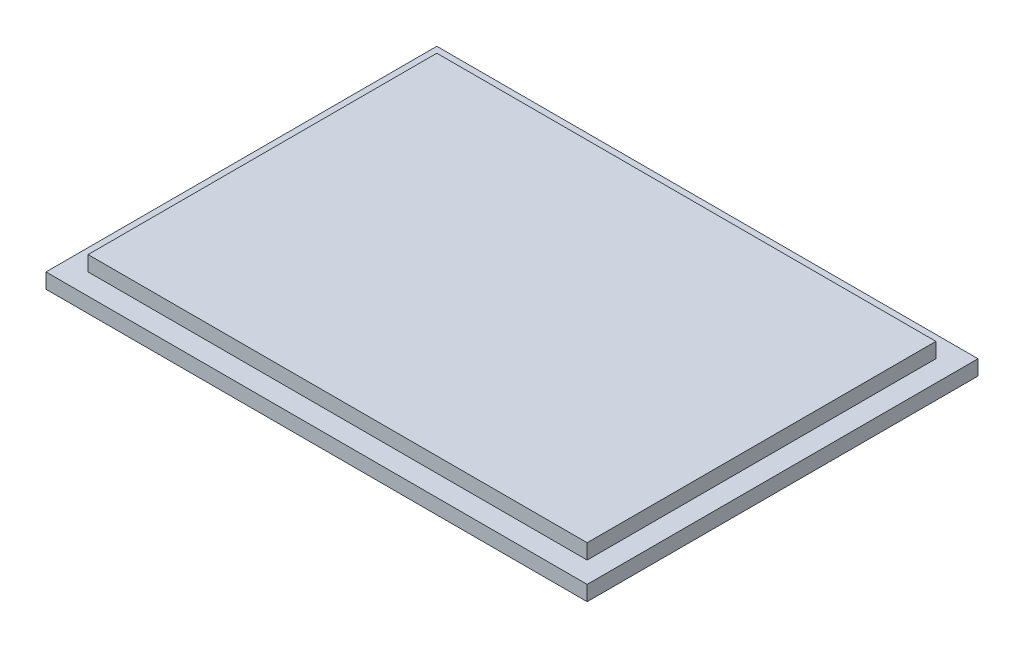
ISO-10303-21;
HEADER;
FILE_DESCRIPTION(('STEP AP214'),'2;1');
FILE_NAME('part.step','',(''),(''),'','','');
FILE_SCHEMA(('AUTOMOTIVE_DESIGN { 1 0 10303 214 1 1 1 1 }'));
ENDSEC;
DATA;
#1=APPLICATION_CONTEXT('core data for automotive mechanical design processes');
#2=APPLICATION_PROTOCOL_DEFINITION('international standard','automotive_design',2000,#1);
#3=PRODUCT_CONTEXT('',#1,'mechanical');
#4=PRODUCT('Part','Part','',(#3));
#5=PRODUCT_RELATED_PRODUCT_CATEGORY('part','',(#4));
#6=PRODUCT_DEFINITION_FORMATION('','',#4);
#7=PRODUCT_DEFINITION_CONTEXT('part definition',#1,'design');
#8=PRODUCT_DEFINITION('design','',#6,#7);
#9=PRODUCT_DEFINITION_SHAPE('','',#8);
#10=(LENGTH_UNIT() NAMED_UNIT(*) SI_UNIT(.MILLI.,.METRE.));
#11=(NAMED_UNIT(*) PLANE_ANGLE_UNIT() SI_UNIT($,.RADIAN.));
#12=(NAMED_UNIT(*) SI_UNIT($,.STERADIAN.) SOLID_ANGLE_UNIT());
#13=UNCERTAINTY_MEASURE_WITH_UNIT(LENGTH_MEASURE(1.E-05),#10,'distance_accuracy_value','');
#14=(GEOMETRIC_REPRESENTATION_CONTEXT(3) GLOBAL_UNCERTAINTY_ASSIGNED_CONTEXT((#13)) GLOBAL_UNIT_ASSIGNED_CONTEXT((#10,
#11,#12)) REPRESENTATION_CONTEXT('',''));
#15=CARTESIAN_POINT('',(0.,0.,0.));
#16=DIRECTION('',(0.,0.,1.));
#17=DIRECTION('',(1.,0.,0.));
#18=AXIS2_PLACEMENT_3D('',#15,#16,#17);
#19=CARTESIAN_POINT('',(-18.,-1.,13.));
#20=DIRECTION('',(0.,0.,1.));
#21=DIRECTION('',(1.,0.,0.));
#22=AXIS2_PLACEMENT_3D('',#19,#20,#21);
#23=PLANE('',#22);
#24=DIRECTION('',(1.,0.,0.));
#25=VECTOR('',#24,1.);
#26=CARTESIAN_POINT('',(-18.,0.,13.));
#27=LINE('',#26,#25);
#28=CARTESIAN_POINT('',(-18.,0.,13.));
#29=VERTEX_POINT('',#28);
#30=CARTESIAN_POINT('',(18.,0.,13.));
#31=VERTEX_POINT('',#30);
#32=EDGE_CURVE('E157',#29,#31,#27,.T.);
#33=ORIENTED_EDGE('',*,*,#32,.F.);
#34=DIRECTION('',(0.,1.,0.));
#35=VECTOR('',#34,1.);
#36=CARTESIAN_POINT('',(-18.,-1.,13.));
#37=LINE('',#36,#35);
#38=CARTESIAN_POINT('',(-18.,-1.,13.));
#39=VERTEX_POINT('',#38);
#40=EDGE_CURVE('E11',#39,#29,#37,.T.);
#41=ORIENTED_EDGE('',*,*,#40,.F.);
#42=DIRECTION('',(1.,0.,0.));
#43=VECTOR('',#42,1.);
#44=CARTESIAN_POINT('',(-18.,-1.,13.));
#45=LINE('',#44,#43);
#46=CARTESIAN_POINT('',(18.,-1.,13.));
#47=VERTEX_POINT('',#46);
#48=EDGE_CURVE('E163',#39,#47,#45,.T.);
#49=ORIENTED_EDGE('',*,*,#48,.T.);
#50=DIRECTION('',(0.,1.,0.));
#51=VECTOR('',#50,1.);
#52=CARTESIAN_POINT('',(18.,-1.,13.));
#53=LINE('',#52,#51);
#54=EDGE_CURVE('E42',#47,#31,#53,.T.);
#55=ORIENTED_EDGE('',*,*,#54,.T.);
#56=EDGE_LOOP('',(#33,#41,#49,#55));
#57=FACE_BOUND('',#56,.T.);
#58=ADVANCED_FACE('F39',(#57),#23,.T.);
#59=CARTESIAN_POINT('',(-18.,-1.,-13.));
#60=DIRECTION('',(-1.,0.,0.));
#61=DIRECTION('',(0.,0.,1.));
#62=AXIS2_PLACEMENT_3D('',#59,#60,#61);
#63=PLANE('',#62);
#64=DIRECTION('',(0.,0.,1.));
#65=VECTOR('',#64,1.);
#66=CARTESIAN_POINT('',(-18.,0.,-13.));
#67=LINE('',#66,#65);
#68=CARTESIAN_POINT('',(-18.,0.,-13.));
#69=VERTEX_POINT('',#68);
#70=EDGE_CURVE('E166',#69,#29,#67,.T.);
#71=ORIENTED_EDGE('',*,*,#70,.F.);
#72=DIRECTION('',(0.,1.,0.));
#73=VECTOR('',#72,1.);
#74=CARTESIAN_POINT('',(-18.,-1.,-13.));
#75=LINE('',#74,#73);
#76=CARTESIAN_POINT('',(-18.,-1.,-13.));
#77=VERTEX_POINT('',#76);
#78=EDGE_CURVE('E48',#77,#69,#75,.T.);
#79=ORIENTED_EDGE('',*,*,#78,.F.);
#80=DIRECTION('',(0.,0.,1.));
#81=VECTOR('',#80,1.);
#82=CARTESIAN_POINT('',(-18.,-1.,-13.));
#83=LINE('',#82,#81);
#84=EDGE_CURVE('E172',#77,#39,#83,.T.);
#85=ORIENTED_EDGE('',*,*,#84,.T.);
#86=ORIENTED_EDGE('',*,*,#40,.T.);
#87=EDGE_LOOP('',(#71,#79,#85,#86));
#88=FACE_BOUND('',#87,.T.);
#89=ADVANCED_FACE('F200',(#88),#63,.T.);
#90=CARTESIAN_POINT('',(-18.,-1.,-13.));
#91=DIRECTION('',(0.,0.,1.));
#92=DIRECTION('',(1.,0.,0.));
#93=AXIS2_PLACEMENT_3D('',#90,#91,#92);
#94=PLANE('',#93);
#95=DIRECTION('',(1.,0.,0.));
#96=VECTOR('',#95,1.);
#97=CARTESIAN_POINT('',(-18.,0.,-13.));
#98=LINE('',#97,#96);
#99=CARTESIAN_POINT('',(18.,0.,-13.));
#100=VERTEX_POINT('',#99);
#101=EDGE_CURVE('E182',#69,#100,#98,.T.);
#102=ORIENTED_EDGE('',*,*,#101,.T.);
#103=DIRECTION('',(0.,1.,0.));
#104=VECTOR('',#103,1.);
#105=CARTESIAN_POINT('',(18.,-1.,-13.));
#106=LINE('',#105,#104);
#107=CARTESIAN_POINT('',(18.,-1.,-13.));
#108=VERTEX_POINT('',#107);
#109=EDGE_CURVE('E189',#108,#100,#106,.T.);
#110=ORIENTED_EDGE('',*,*,#109,.F.);
#111=DIRECTION('',(1.,0.,0.));
#112=VECTOR('',#111,1.);
#113=CARTESIAN_POINT('',(-18.,-1.,-13.));
#114=LINE('',#113,#112);
#115=EDGE_CURVE('E169',#77,#108,#114,.T.);
#116=ORIENTED_EDGE('',*,*,#115,.F.);
#117=ORIENTED_EDGE('',*,*,#78,.T.);
#118=EDGE_LOOP('',(#102,#110,#116,#117));
#119=FACE_BOUND('',#118,.T.);
#120=ADVANCED_FACE('F204',(#119),#94,.F.);
#121=CARTESIAN_POINT('',(18.,-1.,-13.));
#122=DIRECTION('',(-1.,0.,0.));
#123=DIRECTION('',(0.,0.,1.));
#124=AXIS2_PLACEMENT_3D('',#121,#122,#123);
#125=PLANE('',#124);
#126=DIRECTION('',(0.,0.,1.));
#127=VECTOR('',#126,1.);
#128=CARTESIAN_POINT('',(18.,0.,-13.));
#129=LINE('',#128,#127);
#130=EDGE_CURVE('E178',#100,#31,#129,.T.);
#131=ORIENTED_EDGE('',*,*,#130,.T.);
#132=ORIENTED_EDGE('',*,*,#54,.F.);
#133=DIRECTION('',(0.,0.,1.));
#134=VECTOR('',#133,1.);
#135=CARTESIAN_POINT('',(18.,-1.,-13.));
#136=LINE('',#135,#134);
#137=EDGE_CURVE('E89',#108,#47,#136,.T.);
#138=ORIENTED_EDGE('',*,*,#137,.F.);
#139=ORIENTED_EDGE('',*,*,#109,.T.);
#140=EDGE_LOOP('',(#131,#132,#138,#139));
#141=FACE_BOUND('',#140,.T.);
#142=ADVANCED_FACE('F196',(#141),#125,.F.);
#143=CARTESIAN_POINT('',(0.,-1.,0.));
#144=DIRECTION('',(0.,-1.,0.));
#145=DIRECTION('',(0.,0.,-1.));
#146=AXIS2_PLACEMENT_3D('',#143,#144,#145);
#147=PLANE('',#146);
#148=ORIENTED_EDGE('',*,*,#48,.F.);
#149=ORIENTED_EDGE('',*,*,#84,.F.);
#150=ORIENTED_EDGE('',*,*,#115,.T.);
#151=ORIENTED_EDGE('',*,*,#137,.T.);
#152=EDGE_LOOP('',(#148,#149,#150,#151));
#153=FACE_BOUND('',#152,.T.);
#154=ADVANCED_FACE('F205',(#153),#147,.T.);
#155=CARTESIAN_POINT('',(0.,0.,0.));
#156=DIRECTION('',(0.,-1.,0.));
#157=DIRECTION('',(0.,0.,-1.));
#158=AXIS2_PLACEMENT_3D('',#155,#156,#157);
#159=PLANE('',#158);
#160=DIRECTION('',(0.,0.,-1.));
#161=VECTOR('',#160,1.);
#162=CARTESIAN_POINT('',(-16.6,0.,11.6));
#163=LINE('',#162,#161);
#164=CARTESIAN_POINT('',(-16.6,0.,11.6));
#165=VERTEX_POINT('',#164);
#166=CARTESIAN_POINT('',(-16.6,0.,-11.6));
#167=VERTEX_POINT('',#166);
#168=EDGE_CURVE('E138',#165,#167,#163,.T.);
#169=ORIENTED_EDGE('',*,*,#168,.T.);
#170=DIRECTION('',(1.,0.,0.));
#171=VECTOR('',#170,1.);
#172=CARTESIAN_POINT('',(-16.6,0.,-11.6));
#173=LINE('',#172,#171);
#174=CARTESIAN_POINT('',(16.6,0.,-11.6));
#175=VERTEX_POINT('',#174);
#176=EDGE_CURVE('E56',#167,#175,#173,.T.);
#177=ORIENTED_EDGE('',*,*,#176,.T.);
#178=DIRECTION('',(0.,0.,-1.));
#179=VECTOR('',#178,1.);
#180=CARTESIAN_POINT('',(16.6,0.,11.6));
#181=LINE('',#180,#179);
#182=CARTESIAN_POINT('',(16.6,0.,11.6));
#183=VERTEX_POINT('',#182);
#184=EDGE_CURVE('E130',#183,#175,#181,.T.);
#185=ORIENTED_EDGE('',*,*,#184,.F.);
#186=DIRECTION('',(1.,0.,0.));
#187=VECTOR('',#186,1.);
#188=CARTESIAN_POINT('',(-16.6,0.,11.6));
#189=LINE('',#188,#187);
#190=EDGE_CURVE('E142',#165,#183,#189,.T.);
#191=ORIENTED_EDGE('',*,*,#190,.F.);
#192=EDGE_LOOP('',(#169,#177,#185,#191));
#193=FACE_BOUND('',#192,.T.);
#194=ORIENTED_EDGE('',*,*,#32,.T.);
#195=ORIENTED_EDGE('',*,*,#130,.F.);
#196=ORIENTED_EDGE('',*,*,#101,.F.);
#197=ORIENTED_EDGE('',*,*,#70,.T.);
#198=EDGE_LOOP('',(#194,#195,#196,#197));
#199=FACE_BOUND('',#198,.T.);
#200=ADVANCED_FACE('F199',(#193,#199),#159,.F.);
#201=CARTESIAN_POINT('',(-16.6,1.,-11.6));
#202=DIRECTION('',(0.,0.,-1.));
#203=DIRECTION('',(-1.,0.,0.));
#204=AXIS2_PLACEMENT_3D('',#201,#202,#203);
#205=PLANE('',#204);
#206=ORIENTED_EDGE('',*,*,#176,.F.);
#207=DIRECTION('',(0.,-1.,0.));
#208=VECTOR('',#207,1.);
#209=CARTESIAN_POINT('',(-16.6,1.,-11.6));
#210=LINE('',#209,#208);
#211=CARTESIAN_POINT('',(-16.6,1.,-11.6));
#212=VERTEX_POINT('',#211);
#213=EDGE_CURVE('E136',#212,#167,#210,.T.);
#214=ORIENTED_EDGE('',*,*,#213,.F.);
#215=DIRECTION('',(1.,0.,0.));
#216=VECTOR('',#215,1.);
#217=CARTESIAN_POINT('',(-16.6,1.,-11.6));
#218=LINE('',#217,#216);
#219=CARTESIAN_POINT('',(16.6,1.,-11.6));
#220=VERTEX_POINT('',#219);
#221=EDGE_CURVE('E117',#212,#220,#218,.T.);
#222=ORIENTED_EDGE('',*,*,#221,.T.);
#223=DIRECTION('',(0.,-1.,0.));
#224=VECTOR('',#223,1.);
#225=CARTESIAN_POINT('',(16.6,1.,-11.6));
#226=LINE('',#225,#224);
#227=EDGE_CURVE('E127',#220,#175,#226,.T.);
#228=ORIENTED_EDGE('',*,*,#227,.T.);
#229=EDGE_LOOP('',(#206,#214,#222,#228));
#230=FACE_BOUND('',#229,.T.);
#231=ADVANCED_FACE('F135',(#230),#205,.T.);
#232=CARTESIAN_POINT('',(-16.6,1.,11.6));
#233=DIRECTION('',(-1.,0.,0.));
#234=DIRECTION('',(0.,0.,1.));
#235=AXIS2_PLACEMENT_3D('',#232,#233,#234);
#236=PLANE('',#235);
#237=ORIENTED_EDGE('',*,*,#168,.F.);
#238=DIRECTION('',(0.,-1.,0.));
#239=VECTOR('',#238,1.);
#240=CARTESIAN_POINT('',(-16.6,1.,11.6));
#241=LINE('',#240,#239);
#242=CARTESIAN_POINT('',(-16.6,1.,11.6));
#243=VERTEX_POINT('',#242);
#244=EDGE_CURVE('E158',#243,#165,#241,.T.);
#245=ORIENTED_EDGE('',*,*,#244,.F.);
#246=DIRECTION('',(0.,0.,-1.));
#247=VECTOR('',#246,1.);
#248=CARTESIAN_POINT('',(-16.6,1.,11.6));
#249=LINE('',#248,#247);
#250=EDGE_CURVE('E133',#243,#212,#249,.T.);
#251=ORIENTED_EDGE('',*,*,#250,.T.);
#252=ORIENTED_EDGE('',*,*,#213,.T.);
#253=EDGE_LOOP('',(#237,#245,#251,#252));
#254=FACE_BOUND('',#253,.T.);
#255=ADVANCED_FACE('F249',(#254),#236,.T.);
#256=CARTESIAN_POINT('',(-16.6,1.,11.6));
#257=DIRECTION('',(0.,0.,-1.));
#258=DIRECTION('',(-1.,0.,0.));
#259=AXIS2_PLACEMENT_3D('',#256,#257,#258);
#260=PLANE('',#259);
#261=ORIENTED_EDGE('',*,*,#190,.T.);
#262=DIRECTION('',(0.,-1.,0.));
#263=VECTOR('',#262,1.);
#264=CARTESIAN_POINT('',(16.6,1.,11.6));
#265=LINE('',#264,#263);
#266=CARTESIAN_POINT('',(16.6,1.,11.6));
#267=VERTEX_POINT('',#266);
#268=EDGE_CURVE('E132',#267,#183,#265,.T.);
#269=ORIENTED_EDGE('',*,*,#268,.F.);
#270=DIRECTION('',(1.,0.,0.));
#271=VECTOR('',#270,1.);
#272=CARTESIAN_POINT('',(-16.6,1.,11.6));
#273=LINE('',#272,#271);
#274=EDGE_CURVE('E120',#243,#267,#273,.T.);
#275=ORIENTED_EDGE('',*,*,#274,.F.);
#276=ORIENTED_EDGE('',*,*,#244,.T.);
#277=EDGE_LOOP('',(#261,#269,#275,#276));
#278=FACE_BOUND('',#277,.T.);
#279=ADVANCED_FACE('F257',(#278),#260,.F.);
#280=CARTESIAN_POINT('',(16.6,1.,11.6));
#281=DIRECTION('',(-1.,0.,0.));
#282=DIRECTION('',(0.,0.,1.));
#283=AXIS2_PLACEMENT_3D('',#280,#281,#282);
#284=PLANE('',#283);
#285=ORIENTED_EDGE('',*,*,#184,.T.);
#286=ORIENTED_EDGE('',*,*,#227,.F.);
#287=DIRECTION('',(0.,0.,-1.));
#288=VECTOR('',#287,1.);
#289=CARTESIAN_POINT('',(16.6,1.,11.6));
#290=LINE('',#289,#288);
#291=EDGE_CURVE('E112',#267,#220,#290,.T.);
#292=ORIENTED_EDGE('',*,*,#291,.F.);
#293=ORIENTED_EDGE('',*,*,#268,.T.);
#294=EDGE_LOOP('',(#285,#286,#292,#293));
#295=FACE_BOUND('',#294,.T.);
#296=ADVANCED_FACE('F128',(#295),#284,.F.);
#297=CARTESIAN_POINT('',(0.,1.,0.));
#298=DIRECTION('',(0.,1.,0.));
#299=DIRECTION('',(0.,0.,1.));
#300=AXIS2_PLACEMENT_3D('',#297,#298,#299);
#301=PLANE('',#300);
#302=ORIENTED_EDGE('',*,*,#221,.F.);
#303=ORIENTED_EDGE('',*,*,#250,.F.);
#304=ORIENTED_EDGE('',*,*,#274,.T.);
#305=ORIENTED_EDGE('',*,*,#291,.T.);
#306=EDGE_LOOP('',(#302,#303,#304,#305));
#307=FACE_BOUND('',#306,.T.);
#308=ADVANCED_FACE('F114',(#307),#301,.T.);
#309=CLOSED_SHELL('',(#58,#89,#120,#142,#154,#200,#231,#255,#279,#296,#308));
#310=MANIFOLD_SOLID_BREP('B2',#309);
#311=ADVANCED_BREP_SHAPE_REPRESENTATION('',(#18,#310),#14);
#312=SHAPE_DEFINITION_REPRESENTATION(#9,#311);
ENDSEC;
END-ISO-10303-21;
